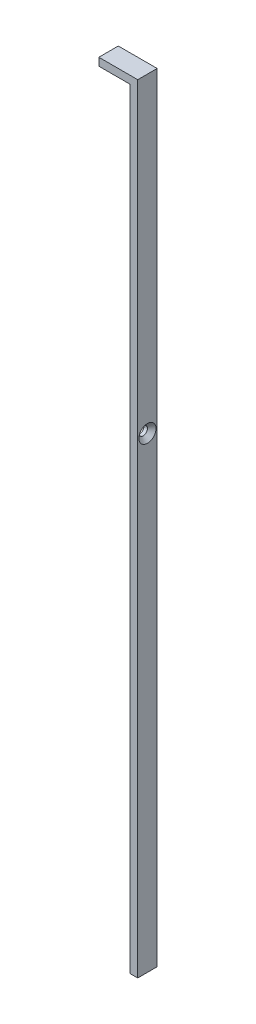
ISO-10303-21;
HEADER;
FILE_DESCRIPTION(('STEP AP214'),'2;1');
FILE_NAME('part.step','',(''),(''),'','','');
FILE_SCHEMA(('AUTOMOTIVE_DESIGN { 1 0 10303 214 1 1 1 1 }'));
ENDSEC;
DATA;
#1=APPLICATION_CONTEXT('core data for automotive mechanical design processes');
#2=APPLICATION_PROTOCOL_DEFINITION('international standard','automotive_design',2000,#1);
#3=PRODUCT_CONTEXT('',#1,'mechanical');
#4=PRODUCT('Part','Part','',(#3));
#5=PRODUCT_RELATED_PRODUCT_CATEGORY('part','',(#4));
#6=PRODUCT_DEFINITION_FORMATION('','',#4);
#7=PRODUCT_DEFINITION_CONTEXT('part definition',#1,'design');
#8=PRODUCT_DEFINITION('design','',#6,#7);
#9=PRODUCT_DEFINITION_SHAPE('','',#8);
#10=(LENGTH_UNIT() NAMED_UNIT(*) SI_UNIT(.MILLI.,.METRE.));
#11=(NAMED_UNIT(*) PLANE_ANGLE_UNIT() SI_UNIT($,.RADIAN.));
#12=(NAMED_UNIT(*) SI_UNIT($,.STERADIAN.) SOLID_ANGLE_UNIT());
#13=UNCERTAINTY_MEASURE_WITH_UNIT(LENGTH_MEASURE(1.E-05),#10,'distance_accuracy_value','');
#14=(GEOMETRIC_REPRESENTATION_CONTEXT(3) GLOBAL_UNCERTAINTY_ASSIGNED_CONTEXT((#13)) GLOBAL_UNIT_ASSIGNED_CONTEXT((#10,
#11,#12)) REPRESENTATION_CONTEXT('',''));
#15=CARTESIAN_POINT('',(0.,0.,0.));
#16=DIRECTION('',(0.,0.,1.));
#17=DIRECTION('',(1.,0.,0.));
#18=AXIS2_PLACEMENT_3D('',#15,#16,#17);
#19=CARTESIAN_POINT('',(-7.99999999999999,2.,5.));
#20=DIRECTION('',(1.,0.,0.));
#21=DIRECTION('',(0.,0.,-1.));
#22=AXIS2_PLACEMENT_3D('',#19,#20,#21);
#23=PLANE('',#22);
#24=DIRECTION('',(0.,-1.,0.));
#25=VECTOR('',#24,1.);
#26=CARTESIAN_POINT('',(-7.99999999999999,2.,0.));
#27=LINE('',#26,#25);
#28=CARTESIAN_POINT('',(-7.99999999999999,2.,0.));
#29=VERTEX_POINT('',#28);
#30=CARTESIAN_POINT('',(-7.99999999999999,0.,0.));
#31=VERTEX_POINT('',#30);
#32=EDGE_CURVE('E117',#29,#31,#27,.T.);
#33=ORIENTED_EDGE('',*,*,#32,.T.);
#34=DIRECTION('',(0.,0.,-1.));
#35=VECTOR('',#34,1.);
#36=CARTESIAN_POINT('',(-7.99999999999999,0.,5.));
#37=LINE('',#36,#35);
#38=CARTESIAN_POINT('',(-7.99999999999999,0.,5.));
#39=VERTEX_POINT('',#38);
#40=EDGE_CURVE('E11',#39,#31,#37,.T.);
#41=ORIENTED_EDGE('',*,*,#40,.F.);
#42=DIRECTION('',(0.,-1.,0.));
#43=VECTOR('',#42,1.);
#44=CARTESIAN_POINT('',(-7.99999999999999,2.,5.));
#45=LINE('',#44,#43);
#46=CARTESIAN_POINT('',(-7.99999999999999,2.,5.));
#47=VERTEX_POINT('',#46);
#48=EDGE_CURVE('E128',#47,#39,#45,.T.);
#49=ORIENTED_EDGE('',*,*,#48,.F.);
#50=DIRECTION('',(0.,0.,-1.));
#51=VECTOR('',#50,1.);
#52=CARTESIAN_POINT('',(-7.99999999999999,2.,5.));
#53=LINE('',#52,#51);
#54=EDGE_CURVE('E113',#47,#29,#53,.T.);
#55=ORIENTED_EDGE('',*,*,#54,.T.);
#56=EDGE_LOOP('',(#33,#41,#49,#55));
#57=FACE_BOUND('',#56,.T.);
#58=ADVANCED_FACE('F33',(#57),#23,.F.);
#59=CARTESIAN_POINT('',(-7.99999999999999,0.,5.));
#60=DIRECTION('',(0.,1.,0.));
#61=DIRECTION('',(0.,0.,1.));
#62=AXIS2_PLACEMENT_3D('',#59,#60,#61);
#63=PLANE('',#62);
#64=DIRECTION('',(1.,0.,0.));
#65=VECTOR('',#64,1.);
#66=CARTESIAN_POINT('',(-7.99999999999999,0.,0.));
#67=LINE('',#66,#65);
#68=CARTESIAN_POINT('',(0.,0.,0.));
#69=VERTEX_POINT('',#68);
#70=EDGE_CURVE('E120',#31,#69,#67,.T.);
#71=ORIENTED_EDGE('',*,*,#70,.T.);
#72=DIRECTION('',(0.,0.,-1.));
#73=VECTOR('',#72,1.);
#74=CARTESIAN_POINT('',(0.,0.,5.));
#75=LINE('',#74,#73);
#76=CARTESIAN_POINT('',(0.,0.,5.));
#77=VERTEX_POINT('',#76);
#78=EDGE_CURVE('E41',#77,#69,#75,.T.);
#79=ORIENTED_EDGE('',*,*,#78,.F.);
#80=DIRECTION('',(1.,0.,0.));
#81=VECTOR('',#80,1.);
#82=CARTESIAN_POINT('',(-7.99999999999999,0.,5.));
#83=LINE('',#82,#81);
#84=EDGE_CURVE('E86',#39,#77,#83,.T.);
#85=ORIENTED_EDGE('',*,*,#84,.F.);
#86=ORIENTED_EDGE('',*,*,#40,.T.);
#87=EDGE_LOOP('',(#71,#79,#85,#86));
#88=FACE_BOUND('',#87,.T.);
#89=ADVANCED_FACE('F153',(#88),#63,.F.);
#90=CARTESIAN_POINT('',(0.,0.,5.));
#91=DIRECTION('',(1.,0.,0.));
#92=DIRECTION('',(0.,1.,0.));
#93=AXIS2_PLACEMENT_3D('',#90,#91,#92);
#94=PLANE('',#93);
#95=CARTESIAN_POINT('',(0.,-78.,2.49999999999999));
#96=DIRECTION('',(1.,0.,0.));
#97=DIRECTION('',(0.,1.,0.));
#98=AXIS2_PLACEMENT_3D('',#95,#96,#97);
#99=CIRCLE('',#98,1.1);
#100=CARTESIAN_POINT('',(0.,-76.9,2.49999999999999));
#101=VERTEX_POINT('',#100);
#102=EDGE_CURVE('E121',#101,#101,#99,.T.);
#103=ORIENTED_EDGE('',*,*,#102,.T.);
#104=EDGE_LOOP('',(#103));
#105=FACE_BOUND('',#104,.T.);
#106=DIRECTION('',(0.,-1.,0.));
#107=VECTOR('',#106,1.);
#108=CARTESIAN_POINT('',(0.,0.,0.));
#109=LINE('',#108,#107);
#110=CARTESIAN_POINT('',(0.,-198.,0.));
#111=VERTEX_POINT('',#110);
#112=EDGE_CURVE('E123',#69,#111,#109,.T.);
#113=ORIENTED_EDGE('',*,*,#112,.T.);
#114=DIRECTION('',(0.,0.,-1.));
#115=VECTOR('',#114,1.);
#116=CARTESIAN_POINT('',(0.,-198.,5.));
#117=LINE('',#116,#115);
#118=CARTESIAN_POINT('',(0.,-198.,5.));
#119=VERTEX_POINT('',#118);
#120=EDGE_CURVE('E108',#119,#111,#117,.T.);
#121=ORIENTED_EDGE('',*,*,#120,.F.);
#122=DIRECTION('',(0.,-1.,0.));
#123=VECTOR('',#122,1.);
#124=CARTESIAN_POINT('',(0.,0.,5.));
#125=LINE('',#124,#123);
#126=EDGE_CURVE('E99',#77,#119,#125,.T.);
#127=ORIENTED_EDGE('',*,*,#126,.F.);
#128=ORIENTED_EDGE('',*,*,#78,.T.);
#129=EDGE_LOOP('',(#113,#121,#127,#128));
#130=FACE_BOUND('',#129,.T.);
#131=ADVANCED_FACE('F134',(#105,#130),#94,.F.);
#132=CARTESIAN_POINT('',(0.,-198.,5.));
#133=DIRECTION('',(0.,1.,0.));
#134=DIRECTION('',(0.,0.,1.));
#135=AXIS2_PLACEMENT_3D('',#132,#133,#134);
#136=PLANE('',#135);
#137=DIRECTION('',(1.,0.,0.));
#138=VECTOR('',#137,1.);
#139=CARTESIAN_POINT('',(0.,-198.,0.));
#140=LINE('',#139,#138);
#141=CARTESIAN_POINT('',(2.00000000000004,-198.,0.));
#142=VERTEX_POINT('',#141);
#143=EDGE_CURVE('E107',#111,#142,#140,.T.);
#144=ORIENTED_EDGE('',*,*,#143,.T.);
#145=DIRECTION('',(0.,0.,-1.));
#146=VECTOR('',#145,1.);
#147=CARTESIAN_POINT('',(2.00000000000004,-198.,5.));
#148=LINE('',#147,#146);
#149=CARTESIAN_POINT('',(2.00000000000004,-198.,5.));
#150=VERTEX_POINT('',#149);
#151=EDGE_CURVE('E104',#150,#142,#148,.T.);
#152=ORIENTED_EDGE('',*,*,#151,.F.);
#153=DIRECTION('',(1.,0.,0.));
#154=VECTOR('',#153,1.);
#155=CARTESIAN_POINT('',(0.,-198.,5.));
#156=LINE('',#155,#154);
#157=EDGE_CURVE('E93',#119,#150,#156,.T.);
#158=ORIENTED_EDGE('',*,*,#157,.F.);
#159=ORIENTED_EDGE('',*,*,#120,.T.);
#160=EDGE_LOOP('',(#144,#152,#158,#159));
#161=FACE_BOUND('',#160,.T.);
#162=ADVANCED_FACE('F105',(#161),#136,.F.);
#163=CARTESIAN_POINT('',(2.00000000000004,-198.,5.));
#164=DIRECTION('',(-1.,0.,0.));
#165=DIRECTION('',(0.,-1.,0.));
#166=AXIS2_PLACEMENT_3D('',#163,#164,#165);
#167=PLANE('',#166);
#168=CARTESIAN_POINT('',(1.99999999999999,-78.,2.49999999999999));
#169=DIRECTION('',(1.,0.,0.));
#170=DIRECTION('',(0.,0.,-1.));
#171=AXIS2_PLACEMENT_3D('',#168,#169,#170);
#172=CIRCLE('',#171,2.19999999999999);
#173=CARTESIAN_POINT('',(1.99999999999999,-78.,0.299999999999997));
#174=VERTEX_POINT('',#173);
#175=EDGE_CURVE('E221',#174,#174,#172,.T.);
#176=ORIENTED_EDGE('',*,*,#175,.F.);
#177=EDGE_LOOP('',(#176));
#178=FACE_BOUND('',#177,.T.);
#179=DIRECTION('',(0.,1.,0.));
#180=VECTOR('',#179,1.);
#181=CARTESIAN_POINT('',(2.00000000000004,-198.,0.));
#182=LINE('',#181,#180);
#183=CARTESIAN_POINT('',(1.99999999999999,2.,0.));
#184=VERTEX_POINT('',#183);
#185=EDGE_CURVE('E72',#142,#184,#182,.T.);
#186=ORIENTED_EDGE('',*,*,#185,.T.);
#187=DIRECTION('',(0.,0.,-1.));
#188=VECTOR('',#187,1.);
#189=CARTESIAN_POINT('',(1.99999999999999,2.,5.));
#190=LINE('',#189,#188);
#191=CARTESIAN_POINT('',(1.99999999999999,2.,5.));
#192=VERTEX_POINT('',#191);
#193=EDGE_CURVE('E109',#192,#184,#190,.T.);
#194=ORIENTED_EDGE('',*,*,#193,.F.);
#195=DIRECTION('',(0.,1.,0.));
#196=VECTOR('',#195,1.);
#197=CARTESIAN_POINT('',(2.00000000000004,-198.,5.));
#198=LINE('',#197,#196);
#199=EDGE_CURVE('E97',#150,#192,#198,.T.);
#200=ORIENTED_EDGE('',*,*,#199,.F.);
#201=ORIENTED_EDGE('',*,*,#151,.T.);
#202=EDGE_LOOP('',(#186,#194,#200,#201));
#203=FACE_BOUND('',#202,.T.);
#204=ADVANCED_FACE('F111',(#178,#203),#167,.F.);
#205=CARTESIAN_POINT('',(1.99999999999999,2.,5.));
#206=DIRECTION('',(0.,-1.,0.));
#207=DIRECTION('',(1.,0.,0.));
#208=AXIS2_PLACEMENT_3D('',#205,#206,#207);
#209=PLANE('',#208);
#210=DIRECTION('',(-1.,0.,0.));
#211=VECTOR('',#210,1.);
#212=CARTESIAN_POINT('',(1.99999999999999,2.,0.));
#213=LINE('',#212,#211);
#214=EDGE_CURVE('E78',#184,#29,#213,.T.);
#215=ORIENTED_EDGE('',*,*,#214,.T.);
#216=ORIENTED_EDGE('',*,*,#54,.F.);
#217=DIRECTION('',(-1.,0.,0.));
#218=VECTOR('',#217,1.);
#219=CARTESIAN_POINT('',(1.99999999999999,2.,5.));
#220=LINE('',#219,#218);
#221=EDGE_CURVE('E49',#192,#47,#220,.T.);
#222=ORIENTED_EDGE('',*,*,#221,.F.);
#223=ORIENTED_EDGE('',*,*,#193,.T.);
#224=EDGE_LOOP('',(#215,#216,#222,#223));
#225=FACE_BOUND('',#224,.T.);
#226=ADVANCED_FACE('F141',(#225),#209,.F.);
#227=CARTESIAN_POINT('',(0.,0.,5.));
#228=DIRECTION('',(0.,0.,1.));
#229=DIRECTION('',(1.,0.,0.));
#230=AXIS2_PLACEMENT_3D('',#227,#228,#229);
#231=PLANE('',#230);
#232=ORIENTED_EDGE('',*,*,#48,.T.);
#233=ORIENTED_EDGE('',*,*,#84,.T.);
#234=ORIENTED_EDGE('',*,*,#126,.T.);
#235=ORIENTED_EDGE('',*,*,#157,.T.);
#236=ORIENTED_EDGE('',*,*,#199,.T.);
#237=ORIENTED_EDGE('',*,*,#221,.T.);
#238=EDGE_LOOP('',(#232,#233,#234,#235,#236,#237));
#239=FACE_BOUND('',#238,.T.);
#240=ADVANCED_FACE('F95',(#239),#231,.T.);
#241=CARTESIAN_POINT('',(0.,0.,0.));
#242=DIRECTION('',(0.,0.,1.));
#243=DIRECTION('',(1.,0.,0.));
#244=AXIS2_PLACEMENT_3D('',#241,#242,#243);
#245=PLANE('',#244);
#246=ORIENTED_EDGE('',*,*,#32,.F.);
#247=ORIENTED_EDGE('',*,*,#214,.F.);
#248=ORIENTED_EDGE('',*,*,#185,.F.);
#249=ORIENTED_EDGE('',*,*,#143,.F.);
#250=ORIENTED_EDGE('',*,*,#112,.F.);
#251=ORIENTED_EDGE('',*,*,#70,.F.);
#252=EDGE_LOOP('',(#246,#247,#248,#249,#250,#251));
#253=FACE_BOUND('',#252,.T.);
#254=ADVANCED_FACE('F137',(#253),#245,.F.);
#255=CARTESIAN_POINT('',(1.99999999999999,-78.,2.49999999999999));
#256=DIRECTION('',(1.,0.,0.));
#257=DIRECTION('',(0.,0.,-1.));
#258=AXIS2_PLACEMENT_3D('',#255,#256,#257);
#259=CYLINDRICAL_SURFACE('',#258,1.1);
#260=ORIENTED_EDGE('',*,*,#102,.F.);
#261=EDGE_LOOP('',(#260));
#262=FACE_BOUND('',#261,.T.);
#263=CARTESIAN_POINT('',(0.899999999999988,-78.,2.49999999999999));
#264=DIRECTION('',(1.,0.,0.));
#265=DIRECTION('',(0.,0.,-1.));
#266=AXIS2_PLACEMENT_3D('',#263,#264,#265);
#267=CIRCLE('',#266,1.1);
#268=CARTESIAN_POINT('',(0.899999999999988,-78.,1.39999999999999));
#269=VERTEX_POINT('',#268);
#270=EDGE_CURVE('E218',#269,#269,#267,.T.);
#271=ORIENTED_EDGE('',*,*,#270,.T.);
#272=EDGE_LOOP('',(#271));
#273=FACE_BOUND('',#272,.T.);
#274=ADVANCED_FACE('F181',(#262,#273),#259,.F.);
#275=CARTESIAN_POINT('',(1.99999999999999,-78.,2.49999999999999));
#276=DIRECTION('',(1.,0.,0.));
#277=DIRECTION('',(0.,0.,-1.));
#278=AXIS2_PLACEMENT_3D('',#275,#276,#277);
#279=CONICAL_SURFACE('',#278,2.19999999999999,0.785398163397443);
#280=ORIENTED_EDGE('',*,*,#270,.F.);
#281=EDGE_LOOP('',(#280));
#282=FACE_BOUND('',#281,.T.);
#283=ORIENTED_EDGE('',*,*,#175,.T.);
#284=EDGE_LOOP('',(#283));
#285=FACE_BOUND('',#284,.T.);
#286=ADVANCED_FACE('F186',(#282,#285),#279,.F.);
#287=CLOSED_SHELL('',(#58,#89,#131,#162,#204,#226,#240,#254,#274,#286));
#288=MANIFOLD_SOLID_BREP('B2',#287);
#289=ADVANCED_BREP_SHAPE_REPRESENTATION('',(#18,#288),#14);
#290=SHAPE_DEFINITION_REPRESENTATION(#9,#289);
ENDSEC;
END-ISO-10303-21;
